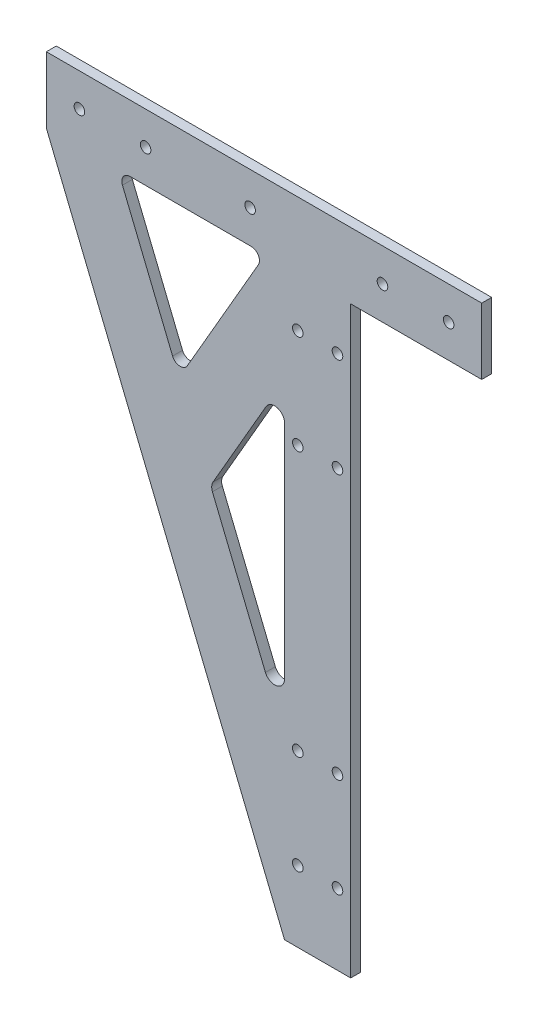
ISO-10303-21;
HEADER;
FILE_DESCRIPTION(('STEP AP214'),'2;1');
FILE_NAME('part.step','',(''),(''),'','','');
FILE_SCHEMA(('AUTOMOTIVE_DESIGN { 1 0 10303 214 1 1 1 1 }'));
ENDSEC;
DATA;
#1=APPLICATION_CONTEXT('core data for automotive mechanical design processes');
#2=APPLICATION_PROTOCOL_DEFINITION('international standard','automotive_design',2000,#1);
#3=PRODUCT_CONTEXT('',#1,'mechanical');
#4=PRODUCT('Part','Part','',(#3));
#5=PRODUCT_RELATED_PRODUCT_CATEGORY('part','',(#4));
#6=PRODUCT_DEFINITION_FORMATION('','',#4);
#7=PRODUCT_DEFINITION_CONTEXT('part definition',#1,'design');
#8=PRODUCT_DEFINITION('design','',#6,#7);
#9=PRODUCT_DEFINITION_SHAPE('','',#8);
#10=(LENGTH_UNIT() NAMED_UNIT(*) SI_UNIT(.MILLI.,.METRE.));
#11=(NAMED_UNIT(*) PLANE_ANGLE_UNIT() SI_UNIT($,.RADIAN.));
#12=(NAMED_UNIT(*) SI_UNIT($,.STERADIAN.) SOLID_ANGLE_UNIT());
#13=UNCERTAINTY_MEASURE_WITH_UNIT(LENGTH_MEASURE(1.E-05),#10,'distance_accuracy_value','');
#14=(GEOMETRIC_REPRESENTATION_CONTEXT(3) GLOBAL_UNCERTAINTY_ASSIGNED_CONTEXT((#13)) GLOBAL_UNIT_ASSIGNED_CONTEXT((#10,
#11,#12)) REPRESENTATION_CONTEXT('',''));
#15=CARTESIAN_POINT('',(0.,0.,0.));
#16=DIRECTION('',(0.,0.,1.));
#17=DIRECTION('',(1.,0.,0.));
#18=AXIS2_PLACEMENT_3D('',#15,#16,#17);
#19=CARTESIAN_POINT('',(0.,0.,3.));
#20=DIRECTION('',(0.,0.,1.));
#21=DIRECTION('',(1.,0.,0.));
#22=AXIS2_PLACEMENT_3D('',#19,#20,#21);
#23=PLANE('',#22);
#24=CARTESIAN_POINT('',(-204.458183995333,9.99999999999998,3.));
#25=DIRECTION('',(0.,0.,1.));
#26=DIRECTION('',(1.,0.,0.));
#27=AXIS2_PLACEMENT_3D('',#24,#25,#26);
#28=CIRCLE('',#27,1.60000000000002);
#29=CARTESIAN_POINT('',(-202.858183995333,9.99999999999998,3.));
#30=VERTEX_POINT('',#29);
#31=EDGE_CURVE('E268',#30,#30,#28,.T.);
#32=ORIENTED_EDGE('',*,*,#31,.F.);
#33=EDGE_LOOP('',(#32));
#34=FACE_BOUND('',#33,.T.);
#35=CARTESIAN_POINT('',(-146.458183995332,-125.,3.));
#36=DIRECTION('',(0.,0.,1.));
#37=DIRECTION('',(1.,0.,0.));
#38=AXIS2_PLACEMENT_3D('',#35,#36,#37);
#39=CIRCLE('',#38,1.59999999999999);
#40=CARTESIAN_POINT('',(-144.858183995332,-125.,3.));
#41=VERTEX_POINT('',#40);
#42=EDGE_CURVE('E280',#41,#41,#39,.T.);
#43=ORIENTED_EDGE('',*,*,#42,.F.);
#44=EDGE_LOOP('',(#43));
#45=FACE_BOUND('',#44,.T.);
#46=CARTESIAN_POINT('',(-146.458183995332,-155.,3.));
#47=DIRECTION('',(0.,0.,1.));
#48=DIRECTION('',(1.,0.,0.));
#49=AXIS2_PLACEMENT_3D('',#46,#47,#48);
#50=CIRCLE('',#49,1.59999999999999);
#51=CARTESIAN_POINT('',(-144.858183995332,-155.,3.));
#52=VERTEX_POINT('',#51);
#53=EDGE_CURVE('E292',#52,#52,#50,.T.);
#54=ORIENTED_EDGE('',*,*,#53,.F.);
#55=EDGE_LOOP('',(#54));
#56=FACE_BOUND('',#55,.T.);
#57=CARTESIAN_POINT('',(-146.458183995333,-15.,3.));
#58=DIRECTION('',(0.,0.,1.));
#59=DIRECTION('',(1.,0.,0.));
#60=AXIS2_PLACEMENT_3D('',#57,#58,#59);
#61=CIRCLE('',#60,1.59999999999999);
#62=CARTESIAN_POINT('',(-144.858183995333,-15.,3.));
#63=VERTEX_POINT('',#62);
#64=EDGE_CURVE('E304',#63,#63,#61,.T.);
#65=ORIENTED_EDGE('',*,*,#64,.F.);
#66=EDGE_LOOP('',(#65));
#67=FACE_BOUND('',#66,.T.);
#68=CARTESIAN_POINT('',(-146.458183995333,-45.,3.));
#69=DIRECTION('',(0.,0.,1.));
#70=DIRECTION('',(1.,0.,0.));
#71=AXIS2_PLACEMENT_3D('',#68,#69,#70);
#72=CIRCLE('',#71,1.59999999999999);
#73=CARTESIAN_POINT('',(-144.858183995333,-45.,3.));
#74=VERTEX_POINT('',#73);
#75=EDGE_CURVE('E316',#74,#74,#72,.T.);
#76=ORIENTED_EDGE('',*,*,#75,.F.);
#77=EDGE_LOOP('',(#76));
#78=FACE_BOUND('',#77,.T.);
#79=CARTESIAN_POINT('',(-132.858183995333,10.,3.));
#80=DIRECTION('',(0.,0.,1.));
#81=DIRECTION('',(1.,0.,0.));
#82=AXIS2_PLACEMENT_3D('',#79,#80,#81);
#83=CIRCLE('',#82,1.60000000000002);
#84=CARTESIAN_POINT('',(-131.258183995333,10.,3.));
#85=VERTEX_POINT('',#84);
#86=EDGE_CURVE('E328',#85,#85,#83,.T.);
#87=ORIENTED_EDGE('',*,*,#86,.F.);
#88=EDGE_LOOP('',(#87));
#89=FACE_BOUND('',#88,.T.);
#90=DIRECTION('',(0.,-1.,0.));
#91=VECTOR('',#90,1.);
#92=CARTESIAN_POINT('',(-234.458183995333,20.,3.));
#93=LINE('',#92,#91);
#94=CARTESIAN_POINT('',(-234.458183995333,20.,3.));
#95=VERTEX_POINT('',#94);
#96=CARTESIAN_POINT('',(-234.458183995333,0.,3.));
#97=VERTEX_POINT('',#96);
#98=EDGE_CURVE('E340',#95,#97,#93,.T.);
#99=ORIENTED_EDGE('',*,*,#98,.T.);
#100=DIRECTION('',(0.377767413930532,-0.925900524339542,0.));
#101=VECTOR('',#100,1.);
#102=CARTESIAN_POINT('',(-234.458183995333,0.,3.));
#103=LINE('',#102,#101);
#104=CARTESIAN_POINT('',(-162.458183995333,-176.470588235295,3.));
#105=VERTEX_POINT('',#104);
#106=EDGE_CURVE('E343',#97,#105,#103,.T.);
#107=ORIENTED_EDGE('',*,*,#106,.T.);
#108=DIRECTION('',(1.,0.,0.));
#109=VECTOR('',#108,1.);
#110=CARTESIAN_POINT('',(-162.458183995333,-176.470588235295,3.));
#111=LINE('',#110,#109);
#112=CARTESIAN_POINT('',(-142.458183995333,-176.470588235295,3.));
#113=VERTEX_POINT('',#112);
#114=EDGE_CURVE('E346',#105,#113,#111,.T.);
#115=ORIENTED_EDGE('',*,*,#114,.T.);
#116=DIRECTION('',(0.,1.,0.));
#117=VECTOR('',#116,1.);
#118=CARTESIAN_POINT('',(-142.458183995333,-176.470588235295,3.));
#119=LINE('',#118,#117);
#120=CARTESIAN_POINT('',(-142.458183995333,0.,3.));
#121=VERTEX_POINT('',#120);
#122=EDGE_CURVE('E348',#113,#121,#119,.T.);
#123=ORIENTED_EDGE('',*,*,#122,.T.);
#124=DIRECTION('',(1.,0.,0.));
#125=VECTOR('',#124,1.);
#126=CARTESIAN_POINT('',(-102.858183995333,0.,3.));
#127=LINE('',#126,#125);
#128=CARTESIAN_POINT('',(-102.858183995333,0.,3.));
#129=VERTEX_POINT('',#128);
#130=EDGE_CURVE('E350',#121,#129,#127,.T.);
#131=ORIENTED_EDGE('',*,*,#130,.T.);
#132=DIRECTION('',(0.,1.,0.));
#133=VECTOR('',#132,1.);
#134=CARTESIAN_POINT('',(-102.858183995333,20.,3.));
#135=LINE('',#134,#133);
#136=CARTESIAN_POINT('',(-102.858183995333,20.,3.));
#137=VERTEX_POINT('',#136);
#138=EDGE_CURVE('E352',#129,#137,#135,.T.);
#139=ORIENTED_EDGE('',*,*,#138,.T.);
#140=DIRECTION('',(-1.,0.,0.));
#141=VECTOR('',#140,1.);
#142=CARTESIAN_POINT('',(-102.863553327282,20.,3.));
#143=LINE('',#142,#141);
#144=EDGE_CURVE('E354',#137,#95,#143,.T.);
#145=ORIENTED_EDGE('',*,*,#144,.T.);
#146=EDGE_LOOP('',(#99,#107,#115,#123,#131,#139,#145));
#147=FACE_BOUND('',#146,.T.);
#148=CARTESIAN_POINT('',(-112.858183995333,10.,3.));
#149=DIRECTION('',(0.,0.,1.));
#150=DIRECTION('',(1.,0.,0.));
#151=AXIS2_PLACEMENT_3D('',#148,#149,#150);
#152=CIRCLE('',#151,1.6);
#153=CARTESIAN_POINT('',(-111.258183995333,10.,3.));
#154=VERTEX_POINT('',#153);
#155=EDGE_CURVE('E334',#154,#154,#152,.T.);
#156=ORIENTED_EDGE('',*,*,#155,.F.);
#157=EDGE_LOOP('',(#156));
#158=FACE_BOUND('',#157,.T.);
#159=CARTESIAN_POINT('',(-172.858183995333,10.,3.));
#160=DIRECTION('',(0.,0.,1.));
#161=DIRECTION('',(1.,0.,0.));
#162=AXIS2_PLACEMENT_3D('',#159,#160,#161);
#163=CIRCLE('',#162,1.59999999999999);
#164=CARTESIAN_POINT('',(-171.258183995333,10.,3.));
#165=VERTEX_POINT('',#164);
#166=EDGE_CURVE('E322',#165,#165,#163,.T.);
#167=ORIENTED_EDGE('',*,*,#166,.F.);
#168=EDGE_LOOP('',(#167));
#169=FACE_BOUND('',#168,.T.);
#170=CARTESIAN_POINT('',(-158.458183995333,-45.,3.));
#171=DIRECTION('',(0.,0.,1.));
#172=DIRECTION('',(1.,0.,0.));
#173=AXIS2_PLACEMENT_3D('',#170,#171,#172);
#174=CIRCLE('',#173,1.59999999999999);
#175=CARTESIAN_POINT('',(-156.858183995333,-45.,3.));
#176=VERTEX_POINT('',#175);
#177=EDGE_CURVE('E310',#176,#176,#174,.T.);
#178=ORIENTED_EDGE('',*,*,#177,.F.);
#179=EDGE_LOOP('',(#178));
#180=FACE_BOUND('',#179,.T.);
#181=CARTESIAN_POINT('',(-158.458183995333,-15.,3.));
#182=DIRECTION('',(0.,0.,1.));
#183=DIRECTION('',(1.,0.,0.));
#184=AXIS2_PLACEMENT_3D('',#181,#182,#183);
#185=CIRCLE('',#184,1.59999999999999);
#186=CARTESIAN_POINT('',(-156.858183995333,-15.,3.));
#187=VERTEX_POINT('',#186);
#188=EDGE_CURVE('E298',#187,#187,#185,.T.);
#189=ORIENTED_EDGE('',*,*,#188,.F.);
#190=EDGE_LOOP('',(#189));
#191=FACE_BOUND('',#190,.T.);
#192=CARTESIAN_POINT('',(-158.458183995332,-155.,3.));
#193=DIRECTION('',(0.,0.,1.));
#194=DIRECTION('',(1.,0.,0.));
#195=AXIS2_PLACEMENT_3D('',#192,#193,#194);
#196=CIRCLE('',#195,1.59999999999999);
#197=CARTESIAN_POINT('',(-156.858183995332,-155.,3.));
#198=VERTEX_POINT('',#197);
#199=EDGE_CURVE('E286',#198,#198,#196,.T.);
#200=ORIENTED_EDGE('',*,*,#199,.F.);
#201=EDGE_LOOP('',(#200));
#202=FACE_BOUND('',#201,.T.);
#203=CARTESIAN_POINT('',(-224.458183995333,9.99999999999998,3.));
#204=DIRECTION('',(0.,0.,1.));
#205=DIRECTION('',(1.,0.,0.));
#206=AXIS2_PLACEMENT_3D('',#203,#204,#205);
#207=CIRCLE('',#206,1.59999999999999);
#208=CARTESIAN_POINT('',(-222.858183995333,9.99999999999998,3.));
#209=VERTEX_POINT('',#208);
#210=EDGE_CURVE('E274',#209,#209,#207,.T.);
#211=ORIENTED_EDGE('',*,*,#210,.F.);
#212=EDGE_LOOP('',(#211));
#213=FACE_BOUND('',#212,.T.);
#214=CARTESIAN_POINT('',(-158.458183995332,-125.,3.));
#215=DIRECTION('',(0.,0.,1.));
#216=DIRECTION('',(1.,0.,0.));
#217=AXIS2_PLACEMENT_3D('',#214,#215,#216);
#218=CIRCLE('',#217,1.59999999999999);
#219=CARTESIAN_POINT('',(-156.858183995332,-125.,3.));
#220=VERTEX_POINT('',#219);
#221=EDGE_CURVE('E262',#220,#220,#218,.T.);
#222=ORIENTED_EDGE('',*,*,#221,.F.);
#223=EDGE_LOOP('',(#222));
#224=FACE_BOUND('',#223,.T.);
#225=DIRECTION('',(0.,1.,0.));
#226=VECTOR('',#225,1.);
#227=CARTESIAN_POINT('',(-162.458183995333,-41.1961524227068,3.));
#228=LINE('',#227,#226);
#229=CARTESIAN_POINT('',(-162.458183995333,-108.23362384281,3.));
#230=VERTEX_POINT('',#229);
#231=CARTESIAN_POINT('',(-162.458183995333,-41.1961524227068,3.));
#232=VERTEX_POINT('',#231);
#233=EDGE_CURVE('E219',#230,#232,#228,.T.);
#234=ORIENTED_EDGE('',*,*,#233,.F.);
#235=CARTESIAN_POINT('',(-165.458183995333,-108.233623842811,3.));
#236=DIRECTION('',(0.,0.,1.));
#237=DIRECTION('',(-1.,0.,0.));
#238=AXIS2_PLACEMENT_3D('',#235,#236,#237);
#239=CIRCLE('',#238,3.);
#240=CARTESIAN_POINT('',(-168.235885568352,-109.366926084602,3.));
#241=VERTEX_POINT('',#240);
#242=EDGE_CURVE('E217',#241,#230,#239,.T.);
#243=ORIENTED_EDGE('',*,*,#242,.F.);
#244=DIRECTION('',(0.377767413930531,-0.925900524339542,0.));
#245=VECTOR('',#244,1.);
#246=CARTESIAN_POINT('',(-168.235885568352,-109.366926084602,3.));
#247=LINE('',#246,#245);
#248=CARTESIAN_POINT('',(-184.261936587168,-70.0873892737789,3.));
#249=VERTEX_POINT('',#248);
#250=EDGE_CURVE('E229',#249,#241,#247,.T.);
#251=ORIENTED_EDGE('',*,*,#250,.F.);
#252=CARTESIAN_POINT('',(-181.484235014149,-68.9540870319873,3.));
#253=DIRECTION('',(0.,0.,1.));
#254=DIRECTION('',(-1.,0.,0.));
#255=AXIS2_PLACEMENT_3D('',#252,#253,#254);
#256=CIRCLE('',#255,3.00000000000001);
#257=CARTESIAN_POINT('',(-184.082311225502,-67.4540870319873,3.));
#258=VERTEX_POINT('',#257);
#259=EDGE_CURVE('E226',#258,#249,#256,.T.);
#260=ORIENTED_EDGE('',*,*,#259,.F.);
#261=DIRECTION('',(-0.499999999999994,-0.866025403784442,0.));
#262=VECTOR('',#261,1.);
#263=CARTESIAN_POINT('',(-184.082311225502,-67.4540870319873,3.));
#264=LINE('',#263,#262);
#265=CARTESIAN_POINT('',(-168.056260206686,-39.6961524227068,3.));
#266=VERTEX_POINT('',#265);
#267=EDGE_CURVE('E224',#266,#258,#264,.T.);
#268=ORIENTED_EDGE('',*,*,#267,.F.);
#269=CARTESIAN_POINT('',(-165.458183995333,-41.1961524227068,3.));
#270=DIRECTION('',(0.,0.,1.));
#271=DIRECTION('',(1.,0.,0.));
#272=AXIS2_PLACEMENT_3D('',#269,#270,#271);
#273=CIRCLE('',#272,3.00000000000001);
#274=EDGE_CURVE('E222',#232,#266,#273,.T.);
#275=ORIENTED_EDGE('',*,*,#274,.F.);
#276=EDGE_LOOP('',(#234,#243,#251,#260,#268,#275));
#277=FACE_BOUND('',#276,.T.);
#278=DIRECTION('',(-1.,0.,0.));
#279=VECTOR('',#278,1.);
#280=CARTESIAN_POINT('',(-209.152667208007,0.,3.));
#281=LINE('',#280,#279);
#282=CARTESIAN_POINT('',(-172.544179416893,0.,3.));
#283=VERTEX_POINT('',#282);
#284=CARTESIAN_POINT('',(-209.152667208007,0.,3.));
#285=VERTEX_POINT('',#284);
#286=EDGE_CURVE('E174',#283,#285,#281,.T.);
#287=ORIENTED_EDGE('',*,*,#286,.F.);
#288=CARTESIAN_POINT('',(-172.544179416893,-2.48981883834943,3.));
#289=DIRECTION('',(0.,0.,1.));
#290=DIRECTION('',(1.,0.,0.));
#291=AXIS2_PLACEMENT_3D('',#288,#289,#290);
#292=CIRCLE('',#291,2.48981883834942);
#293=CARTESIAN_POINT('',(-170.387933052061,-3.73472825752405,3.));
#294=VERTEX_POINT('',#293);
#295=EDGE_CURVE('E166',#294,#283,#292,.T.);
#296=ORIENTED_EDGE('',*,*,#295,.F.);
#297=DIRECTION('',(0.499999999999995,0.866025403784441,0.));
#298=VECTOR('',#297,1.);
#299=CARTESIAN_POINT('',(-170.387933052061,-3.73472825752405,3.));
#300=LINE('',#299,#298);
#301=CARTESIAN_POINT('',(-191.838092393072,-40.8874940666029,3.));
#302=VERTEX_POINT('',#301);
#303=EDGE_CURVE('E195',#302,#294,#300,.T.);
#304=ORIENTED_EDGE('',*,*,#303,.F.);
#305=CARTESIAN_POINT('',(-193.994338757903,-39.6425846474281,3.));
#306=DIRECTION('',(0.,0.,1.));
#307=DIRECTION('',(-1.,0.,0.));
#308=AXIS2_PLACEMENT_3D('',#305,#306,#307);
#309=CIRCLE('',#308,2.48981883834939);
#310=CARTESIAN_POINT('',(-196.299663325841,-40.583157071147,3.));
#311=VERTEX_POINT('',#310);
#312=EDGE_CURVE('E193',#311,#302,#309,.T.);
#313=ORIENTED_EDGE('',*,*,#312,.F.);
#314=DIRECTION('',(0.377767413930531,-0.925900524339542,0.));
#315=VECTOR('',#314,1.);
#316=CARTESIAN_POINT('',(-196.299663325841,-40.583157071147,3.));
#317=LINE('',#316,#315);
#318=CARTESIAN_POINT('',(-211.457991775945,-3.43039126206821,3.));
#319=VERTEX_POINT('',#318);
#320=EDGE_CURVE('E189',#319,#311,#317,.T.);
#321=ORIENTED_EDGE('',*,*,#320,.F.);
#322=CARTESIAN_POINT('',(-209.152667208007,-2.48981883834943,3.));
#323=DIRECTION('',(0.,0.,1.));
#324=DIRECTION('',(-1.,0.,0.));
#325=AXIS2_PLACEMENT_3D('',#322,#323,#324);
#326=CIRCLE('',#325,2.48981883834942);
#327=EDGE_CURVE('E187',#285,#319,#326,.T.);
#328=ORIENTED_EDGE('',*,*,#327,.F.);
#329=EDGE_LOOP('',(#287,#296,#304,#313,#321,#328));
#330=FACE_BOUND('',#329,.T.);
#331=ADVANCED_FACE('F35',(#34,#45,#56,#67,#78,#89,#147,#158,#169,#180,#191,#202,#213,#224,#277,
#330),#23,.T.);
#332=CARTESIAN_POINT('',(0.,0.,0.));
#333=DIRECTION('',(0.,0.,1.));
#334=DIRECTION('',(1.,0.,0.));
#335=AXIS2_PLACEMENT_3D('',#332,#333,#334);
#336=PLANE('',#335);
#337=CARTESIAN_POINT('',(-165.458183995333,-108.233623842811,0.));
#338=DIRECTION('',(0.,0.,1.));
#339=DIRECTION('',(-1.,0.,0.));
#340=AXIS2_PLACEMENT_3D('',#337,#338,#339);
#341=CIRCLE('',#340,3.);
#342=CARTESIAN_POINT('',(-168.235885568352,-109.366926084602,0.));
#343=VERTEX_POINT('',#342);
#344=CARTESIAN_POINT('',(-162.458183995333,-108.23362384281,0.));
#345=VERTEX_POINT('',#344);
#346=EDGE_CURVE('E182',#343,#345,#341,.T.);
#347=ORIENTED_EDGE('',*,*,#346,.T.);
#348=DIRECTION('',(0.,1.,0.));
#349=VECTOR('',#348,1.);
#350=CARTESIAN_POINT('',(-162.458183995333,-41.1961524227068,0.));
#351=LINE('',#350,#349);
#352=CARTESIAN_POINT('',(-162.458183995333,-41.1961524227068,0.));
#353=VERTEX_POINT('',#352);
#354=EDGE_CURVE('E234',#345,#353,#351,.T.);
#355=ORIENTED_EDGE('',*,*,#354,.T.);
#356=CARTESIAN_POINT('',(-165.458183995333,-41.1961524227068,0.));
#357=DIRECTION('',(0.,0.,1.));
#358=DIRECTION('',(1.,0.,0.));
#359=AXIS2_PLACEMENT_3D('',#356,#357,#358);
#360=CIRCLE('',#359,3.00000000000001);
#361=CARTESIAN_POINT('',(-168.056260206686,-39.6961524227068,0.));
#362=VERTEX_POINT('',#361);
#363=EDGE_CURVE('E237',#353,#362,#360,.T.);
#364=ORIENTED_EDGE('',*,*,#363,.T.);
#365=DIRECTION('',(-0.499999999999994,-0.866025403784442,0.));
#366=VECTOR('',#365,1.);
#367=CARTESIAN_POINT('',(-184.082311225502,-67.4540870319873,0.));
#368=LINE('',#367,#366);
#369=CARTESIAN_POINT('',(-184.082311225502,-67.4540870319873,0.));
#370=VERTEX_POINT('',#369);
#371=EDGE_CURVE('E240',#362,#370,#368,.T.);
#372=ORIENTED_EDGE('',*,*,#371,.T.);
#373=CARTESIAN_POINT('',(-181.484235014149,-68.9540870319873,0.));
#374=DIRECTION('',(0.,0.,1.));
#375=DIRECTION('',(-1.,0.,0.));
#376=AXIS2_PLACEMENT_3D('',#373,#374,#375);
#377=CIRCLE('',#376,3.00000000000001);
#378=CARTESIAN_POINT('',(-184.261936587168,-70.0873892737789,0.));
#379=VERTEX_POINT('',#378);
#380=EDGE_CURVE('E243',#370,#379,#377,.T.);
#381=ORIENTED_EDGE('',*,*,#380,.T.);
#382=DIRECTION('',(0.377767413930531,-0.925900524339542,0.));
#383=VECTOR('',#382,1.);
#384=CARTESIAN_POINT('',(-168.235885568352,-109.366926084602,0.));
#385=LINE('',#384,#383);
#386=EDGE_CURVE('E220',#379,#343,#385,.T.);
#387=ORIENTED_EDGE('',*,*,#386,.T.);
#388=EDGE_LOOP('',(#347,#355,#364,#372,#381,#387));
#389=FACE_BOUND('',#388,.T.);
#390=DIRECTION('',(0.,-1.,0.));
#391=VECTOR('',#390,1.);
#392=CARTESIAN_POINT('',(-234.458183995333,20.,0.));
#393=LINE('',#392,#391);
#394=CARTESIAN_POINT('',(-234.458183995333,20.,0.));
#395=VERTEX_POINT('',#394);
#396=CARTESIAN_POINT('',(-234.458183995333,0.,0.));
#397=VERTEX_POINT('',#396);
#398=EDGE_CURVE('E337',#395,#397,#393,.T.);
#399=ORIENTED_EDGE('',*,*,#398,.F.);
#400=DIRECTION('',(-1.,0.,0.));
#401=VECTOR('',#400,1.);
#402=CARTESIAN_POINT('',(-102.863553327282,20.,0.));
#403=LINE('',#402,#401);
#404=CARTESIAN_POINT('',(-102.858183995333,20.,0.));
#405=VERTEX_POINT('',#404);
#406=EDGE_CURVE('E344',#405,#395,#403,.T.);
#407=ORIENTED_EDGE('',*,*,#406,.F.);
#408=DIRECTION('',(0.,1.,0.));
#409=VECTOR('',#408,1.);
#410=CARTESIAN_POINT('',(-102.858183995333,20.,0.));
#411=LINE('',#410,#409);
#412=CARTESIAN_POINT('',(-102.858183995333,0.,0.));
#413=VERTEX_POINT('',#412);
#414=EDGE_CURVE('E367',#413,#405,#411,.T.);
#415=ORIENTED_EDGE('',*,*,#414,.F.);
#416=DIRECTION('',(1.,0.,0.));
#417=VECTOR('',#416,1.);
#418=CARTESIAN_POINT('',(-102.858183995333,0.,0.));
#419=LINE('',#418,#417);
#420=CARTESIAN_POINT('',(-142.458183995333,0.,0.));
#421=VERTEX_POINT('',#420);
#422=EDGE_CURVE('E365',#421,#413,#419,.T.);
#423=ORIENTED_EDGE('',*,*,#422,.F.);
#424=DIRECTION('',(0.,1.,0.));
#425=VECTOR('',#424,1.);
#426=CARTESIAN_POINT('',(-142.458183995333,-176.470588235295,0.));
#427=LINE('',#426,#425);
#428=CARTESIAN_POINT('',(-142.458183995333,-176.470588235295,0.));
#429=VERTEX_POINT('',#428);
#430=EDGE_CURVE('E363',#429,#421,#427,.T.);
#431=ORIENTED_EDGE('',*,*,#430,.F.);
#432=DIRECTION('',(1.,0.,0.));
#433=VECTOR('',#432,1.);
#434=CARTESIAN_POINT('',(-162.458183995333,-176.470588235295,0.));
#435=LINE('',#434,#433);
#436=CARTESIAN_POINT('',(-162.458183995333,-176.470588235295,0.));
#437=VERTEX_POINT('',#436);
#438=EDGE_CURVE('E361',#437,#429,#435,.T.);
#439=ORIENTED_EDGE('',*,*,#438,.F.);
#440=DIRECTION('',(0.377767413930532,-0.925900524339542,0.));
#441=VECTOR('',#440,1.);
#442=CARTESIAN_POINT('',(-234.458183995333,0.,0.));
#443=LINE('',#442,#441);
#444=EDGE_CURVE('E359',#397,#437,#443,.T.);
#445=ORIENTED_EDGE('',*,*,#444,.F.);
#446=EDGE_LOOP('',(#399,#407,#415,#423,#431,#439,#445));
#447=FACE_BOUND('',#446,.T.);
#448=CARTESIAN_POINT('',(-112.858183995333,10.,0.));
#449=DIRECTION('',(0.,0.,1.));
#450=DIRECTION('',(1.,0.,0.));
#451=AXIS2_PLACEMENT_3D('',#448,#449,#450);
#452=CIRCLE('',#451,1.6);
#453=CARTESIAN_POINT('',(-111.258183995333,10.,0.));
#454=VERTEX_POINT('',#453);
#455=EDGE_CURVE('E331',#454,#454,#452,.T.);
#456=ORIENTED_EDGE('',*,*,#455,.T.);
#457=EDGE_LOOP('',(#456));
#458=FACE_BOUND('',#457,.T.);
#459=CARTESIAN_POINT('',(-132.858183995333,10.,0.));
#460=DIRECTION('',(0.,0.,1.));
#461=DIRECTION('',(1.,0.,0.));
#462=AXIS2_PLACEMENT_3D('',#459,#460,#461);
#463=CIRCLE('',#462,1.60000000000002);
#464=CARTESIAN_POINT('',(-131.258183995333,10.,0.));
#465=VERTEX_POINT('',#464);
#466=EDGE_CURVE('E325',#465,#465,#463,.T.);
#467=ORIENTED_EDGE('',*,*,#466,.T.);
#468=EDGE_LOOP('',(#467));
#469=FACE_BOUND('',#468,.T.);
#470=CARTESIAN_POINT('',(-172.858183995333,10.,0.));
#471=DIRECTION('',(0.,0.,1.));
#472=DIRECTION('',(1.,0.,0.));
#473=AXIS2_PLACEMENT_3D('',#470,#471,#472);
#474=CIRCLE('',#473,1.59999999999999);
#475=CARTESIAN_POINT('',(-171.258183995333,10.,0.));
#476=VERTEX_POINT('',#475);
#477=EDGE_CURVE('E319',#476,#476,#474,.T.);
#478=ORIENTED_EDGE('',*,*,#477,.T.);
#479=EDGE_LOOP('',(#478));
#480=FACE_BOUND('',#479,.T.);
#481=CARTESIAN_POINT('',(-146.458183995333,-45.,0.));
#482=DIRECTION('',(0.,0.,1.));
#483=DIRECTION('',(1.,0.,0.));
#484=AXIS2_PLACEMENT_3D('',#481,#482,#483);
#485=CIRCLE('',#484,1.59999999999999);
#486=CARTESIAN_POINT('',(-144.858183995333,-45.,0.));
#487=VERTEX_POINT('',#486);
#488=EDGE_CURVE('E313',#487,#487,#485,.T.);
#489=ORIENTED_EDGE('',*,*,#488,.T.);
#490=EDGE_LOOP('',(#489));
#491=FACE_BOUND('',#490,.T.);
#492=CARTESIAN_POINT('',(-158.458183995333,-45.,0.));
#493=DIRECTION('',(0.,0.,1.));
#494=DIRECTION('',(1.,0.,0.));
#495=AXIS2_PLACEMENT_3D('',#492,#493,#494);
#496=CIRCLE('',#495,1.59999999999999);
#497=CARTESIAN_POINT('',(-156.858183995333,-45.,0.));
#498=VERTEX_POINT('',#497);
#499=EDGE_CURVE('E307',#498,#498,#496,.T.);
#500=ORIENTED_EDGE('',*,*,#499,.T.);
#501=EDGE_LOOP('',(#500));
#502=FACE_BOUND('',#501,.T.);
#503=CARTESIAN_POINT('',(-146.458183995333,-15.,0.));
#504=DIRECTION('',(0.,0.,1.));
#505=DIRECTION('',(1.,0.,0.));
#506=AXIS2_PLACEMENT_3D('',#503,#504,#505);
#507=CIRCLE('',#506,1.59999999999999);
#508=CARTESIAN_POINT('',(-144.858183995333,-15.,0.));
#509=VERTEX_POINT('',#508);
#510=EDGE_CURVE('E301',#509,#509,#507,.T.);
#511=ORIENTED_EDGE('',*,*,#510,.T.);
#512=EDGE_LOOP('',(#511));
#513=FACE_BOUND('',#512,.T.);
#514=CARTESIAN_POINT('',(-158.458183995333,-15.,0.));
#515=DIRECTION('',(0.,0.,1.));
#516=DIRECTION('',(1.,0.,0.));
#517=AXIS2_PLACEMENT_3D('',#514,#515,#516);
#518=CIRCLE('',#517,1.59999999999999);
#519=CARTESIAN_POINT('',(-156.858183995333,-15.,0.));
#520=VERTEX_POINT('',#519);
#521=EDGE_CURVE('E295',#520,#520,#518,.T.);
#522=ORIENTED_EDGE('',*,*,#521,.T.);
#523=EDGE_LOOP('',(#522));
#524=FACE_BOUND('',#523,.T.);
#525=CARTESIAN_POINT('',(-146.458183995332,-155.,0.));
#526=DIRECTION('',(0.,0.,1.));
#527=DIRECTION('',(1.,0.,0.));
#528=AXIS2_PLACEMENT_3D('',#525,#526,#527);
#529=CIRCLE('',#528,1.59999999999999);
#530=CARTESIAN_POINT('',(-144.858183995332,-155.,0.));
#531=VERTEX_POINT('',#530);
#532=EDGE_CURVE('E289',#531,#531,#529,.T.);
#533=ORIENTED_EDGE('',*,*,#532,.T.);
#534=EDGE_LOOP('',(#533));
#535=FACE_BOUND('',#534,.T.);
#536=CARTESIAN_POINT('',(-158.458183995332,-155.,0.));
#537=DIRECTION('',(0.,0.,1.));
#538=DIRECTION('',(1.,0.,0.));
#539=AXIS2_PLACEMENT_3D('',#536,#537,#538);
#540=CIRCLE('',#539,1.59999999999999);
#541=CARTESIAN_POINT('',(-156.858183995332,-155.,0.));
#542=VERTEX_POINT('',#541);
#543=EDGE_CURVE('E283',#542,#542,#540,.T.);
#544=ORIENTED_EDGE('',*,*,#543,.T.);
#545=EDGE_LOOP('',(#544));
#546=FACE_BOUND('',#545,.T.);
#547=CARTESIAN_POINT('',(-146.458183995332,-125.,0.));
#548=DIRECTION('',(0.,0.,1.));
#549=DIRECTION('',(1.,0.,0.));
#550=AXIS2_PLACEMENT_3D('',#547,#548,#549);
#551=CIRCLE('',#550,1.59999999999999);
#552=CARTESIAN_POINT('',(-144.858183995332,-125.,0.));
#553=VERTEX_POINT('',#552);
#554=EDGE_CURVE('E277',#553,#553,#551,.T.);
#555=ORIENTED_EDGE('',*,*,#554,.T.);
#556=EDGE_LOOP('',(#555));
#557=FACE_BOUND('',#556,.T.);
#558=CARTESIAN_POINT('',(-224.458183995333,9.99999999999998,0.));
#559=DIRECTION('',(0.,0.,1.));
#560=DIRECTION('',(1.,0.,0.));
#561=AXIS2_PLACEMENT_3D('',#558,#559,#560);
#562=CIRCLE('',#561,1.59999999999999);
#563=CARTESIAN_POINT('',(-222.858183995333,9.99999999999998,0.));
#564=VERTEX_POINT('',#563);
#565=EDGE_CURVE('E271',#564,#564,#562,.T.);
#566=ORIENTED_EDGE('',*,*,#565,.T.);
#567=EDGE_LOOP('',(#566));
#568=FACE_BOUND('',#567,.T.);
#569=CARTESIAN_POINT('',(-204.458183995333,9.99999999999998,0.));
#570=DIRECTION('',(0.,0.,1.));
#571=DIRECTION('',(1.,0.,0.));
#572=AXIS2_PLACEMENT_3D('',#569,#570,#571);
#573=CIRCLE('',#572,1.60000000000002);
#574=CARTESIAN_POINT('',(-202.858183995333,9.99999999999998,0.));
#575=VERTEX_POINT('',#574);
#576=EDGE_CURVE('E265',#575,#575,#573,.T.);
#577=ORIENTED_EDGE('',*,*,#576,.T.);
#578=EDGE_LOOP('',(#577));
#579=FACE_BOUND('',#578,.T.);
#580=CARTESIAN_POINT('',(-158.458183995332,-125.,0.));
#581=DIRECTION('',(0.,0.,1.));
#582=DIRECTION('',(1.,0.,0.));
#583=AXIS2_PLACEMENT_3D('',#580,#581,#582);
#584=CIRCLE('',#583,1.59999999999999);
#585=CARTESIAN_POINT('',(-156.858183995332,-125.,0.));
#586=VERTEX_POINT('',#585);
#587=EDGE_CURVE('E261',#586,#586,#584,.T.);
#588=ORIENTED_EDGE('',*,*,#587,.T.);
#589=EDGE_LOOP('',(#588));
#590=FACE_BOUND('',#589,.T.);
#591=CARTESIAN_POINT('',(-172.544179416893,-2.48981883834943,0.));
#592=DIRECTION('',(0.,0.,1.));
#593=DIRECTION('',(1.,0.,0.));
#594=AXIS2_PLACEMENT_3D('',#591,#592,#593);
#595=CIRCLE('',#594,2.48981883834942);
#596=CARTESIAN_POINT('',(-170.387933052061,-3.73472825752404,0.));
#597=VERTEX_POINT('',#596);
#598=CARTESIAN_POINT('',(-172.544179416893,0.,0.));
#599=VERTEX_POINT('',#598);
#600=EDGE_CURVE('E58',#597,#599,#595,.T.);
#601=ORIENTED_EDGE('',*,*,#600,.T.);
#602=DIRECTION('',(-1.,0.,0.));
#603=VECTOR('',#602,1.);
#604=CARTESIAN_POINT('',(-209.152667208007,0.,0.));
#605=LINE('',#604,#603);
#606=CARTESIAN_POINT('',(-209.152667208007,0.,0.));
#607=VERTEX_POINT('',#606);
#608=EDGE_CURVE('E181',#599,#607,#605,.T.);
#609=ORIENTED_EDGE('',*,*,#608,.T.);
#610=CARTESIAN_POINT('',(-209.152667208007,-2.48981883834943,0.));
#611=DIRECTION('',(0.,0.,1.));
#612=DIRECTION('',(-1.,0.,0.));
#613=AXIS2_PLACEMENT_3D('',#610,#611,#612);
#614=CIRCLE('',#613,2.48981883834942);
#615=CARTESIAN_POINT('',(-211.457991775945,-3.43039126206821,0.));
#616=VERTEX_POINT('',#615);
#617=EDGE_CURVE('E199',#607,#616,#614,.T.);
#618=ORIENTED_EDGE('',*,*,#617,.T.);
#619=DIRECTION('',(0.377767413930531,-0.925900524339542,0.));
#620=VECTOR('',#619,1.);
#621=CARTESIAN_POINT('',(-196.299663325841,-40.583157071147,0.));
#622=LINE('',#621,#620);
#623=CARTESIAN_POINT('',(-196.299663325841,-40.583157071147,0.));
#624=VERTEX_POINT('',#623);
#625=EDGE_CURVE('E202',#616,#624,#622,.T.);
#626=ORIENTED_EDGE('',*,*,#625,.T.);
#627=CARTESIAN_POINT('',(-193.994338757903,-39.6425846474281,0.));
#628=DIRECTION('',(0.,0.,1.));
#629=DIRECTION('',(-1.,0.,0.));
#630=AXIS2_PLACEMENT_3D('',#627,#628,#629);
#631=CIRCLE('',#630,2.48981883834939);
#632=CARTESIAN_POINT('',(-191.838092393072,-40.8874940666029,0.));
#633=VERTEX_POINT('',#632);
#634=EDGE_CURVE('E205',#624,#633,#631,.T.);
#635=ORIENTED_EDGE('',*,*,#634,.T.);
#636=DIRECTION('',(0.499999999999995,0.866025403784441,0.));
#637=VECTOR('',#636,1.);
#638=CARTESIAN_POINT('',(-170.387933052061,-3.73472825752405,0.));
#639=LINE('',#638,#637);
#640=EDGE_CURVE('E175',#633,#597,#639,.T.);
#641=ORIENTED_EDGE('',*,*,#640,.T.);
#642=EDGE_LOOP('',(#601,#609,#618,#626,#635,#641));
#643=FACE_BOUND('',#642,.T.);
#644=ADVANCED_FACE('F395',(#389,#447,#458,#469,#480,#491,#502,#513,#524,#535,#546,#557,#568,
#579,#590,#643),#336,.F.);
#645=CARTESIAN_POINT('',(-234.458183995333,20.,3.));
#646=DIRECTION('',(1.,0.,0.));
#647=DIRECTION('',(0.,0.,-1.));
#648=AXIS2_PLACEMENT_3D('',#645,#646,#647);
#649=PLANE('',#648);
#650=ORIENTED_EDGE('',*,*,#398,.T.);
#651=DIRECTION('',(0.,0.,-1.));
#652=VECTOR('',#651,1.);
#653=CARTESIAN_POINT('',(-234.458183995333,0.,3.));
#654=LINE('',#653,#652);
#655=EDGE_CURVE('E11',#97,#397,#654,.T.);
#656=ORIENTED_EDGE('',*,*,#655,.F.);
#657=ORIENTED_EDGE('',*,*,#98,.F.);
#658=DIRECTION('',(0.,0.,-1.));
#659=VECTOR('',#658,1.);
#660=CARTESIAN_POINT('',(-234.458183995333,20.,3.));
#661=LINE('',#660,#659);
#662=EDGE_CURVE('E356',#95,#395,#661,.T.);
#663=ORIENTED_EDGE('',*,*,#662,.T.);
#664=EDGE_LOOP('',(#650,#656,#657,#663));
#665=FACE_BOUND('',#664,.T.);
#666=ADVANCED_FACE('F37',(#665),#649,.F.);
#667=CARTESIAN_POINT('',(-234.458183995333,0.,3.));
#668=DIRECTION('',(0.925900524339542,0.377767413930532,0.));
#669=DIRECTION('',(-0.377767413930532,0.925900524339542,0.));
#670=AXIS2_PLACEMENT_3D('',#667,#668,#669);
#671=PLANE('',#670);
#672=ORIENTED_EDGE('',*,*,#444,.T.);
#673=DIRECTION('',(0.,0.,-1.));
#674=VECTOR('',#673,1.);
#675=CARTESIAN_POINT('',(-162.458183995333,-176.470588235295,3.));
#676=LINE('',#675,#674);
#677=EDGE_CURVE('E43',#105,#437,#676,.T.);
#678=ORIENTED_EDGE('',*,*,#677,.F.);
#679=ORIENTED_EDGE('',*,*,#106,.F.);
#680=ORIENTED_EDGE('',*,*,#655,.T.);
#681=EDGE_LOOP('',(#672,#678,#679,#680));
#682=FACE_BOUND('',#681,.T.);
#683=ADVANCED_FACE('F413',(#682),#671,.F.);
#684=CARTESIAN_POINT('',(-162.458183995333,-176.470588235295,3.));
#685=DIRECTION('',(0.,1.,0.));
#686=DIRECTION('',(0.,0.,1.));
#687=AXIS2_PLACEMENT_3D('',#684,#685,#686);
#688=PLANE('',#687);
#689=ORIENTED_EDGE('',*,*,#438,.T.);
#690=DIRECTION('',(0.,0.,-1.));
#691=VECTOR('',#690,1.);
#692=CARTESIAN_POINT('',(-142.458183995333,-176.470588235295,3.));
#693=LINE('',#692,#691);
#694=EDGE_CURVE('E382',#113,#429,#693,.T.);
#695=ORIENTED_EDGE('',*,*,#694,.F.);
#696=ORIENTED_EDGE('',*,*,#114,.F.);
#697=ORIENTED_EDGE('',*,*,#677,.T.);
#698=EDGE_LOOP('',(#689,#695,#696,#697));
#699=FACE_BOUND('',#698,.T.);
#700=ADVANCED_FACE('F389',(#699),#688,.F.);
#701=CARTESIAN_POINT('',(-142.458183995333,-176.470588235295,3.));
#702=DIRECTION('',(-1.,0.,0.));
#703=DIRECTION('',(0.,0.,1.));
#704=AXIS2_PLACEMENT_3D('',#701,#702,#703);
#705=PLANE('',#704);
#706=ORIENTED_EDGE('',*,*,#430,.T.);
#707=DIRECTION('',(0.,0.,-1.));
#708=VECTOR('',#707,1.);
#709=CARTESIAN_POINT('',(-142.458183995333,0.,3.));
#710=LINE('',#709,#708);
#711=EDGE_CURVE('E379',#121,#421,#710,.T.);
#712=ORIENTED_EDGE('',*,*,#711,.F.);
#713=ORIENTED_EDGE('',*,*,#122,.F.);
#714=ORIENTED_EDGE('',*,*,#694,.T.);
#715=EDGE_LOOP('',(#706,#712,#713,#714));
#716=FACE_BOUND('',#715,.T.);
#717=ADVANCED_FACE('F401',(#716),#705,.F.);
#718=CARTESIAN_POINT('',(-102.858183995333,0.,3.));
#719=DIRECTION('',(0.,1.,0.));
#720=DIRECTION('',(0.,0.,1.));
#721=AXIS2_PLACEMENT_3D('',#718,#719,#720);
#722=PLANE('',#721);
#723=ORIENTED_EDGE('',*,*,#422,.T.);
#724=DIRECTION('',(0.,0.,-1.));
#725=VECTOR('',#724,1.);
#726=CARTESIAN_POINT('',(-102.858183995333,0.,3.));
#727=LINE('',#726,#725);
#728=EDGE_CURVE('E376',#129,#413,#727,.T.);
#729=ORIENTED_EDGE('',*,*,#728,.F.);
#730=ORIENTED_EDGE('',*,*,#130,.F.);
#731=ORIENTED_EDGE('',*,*,#711,.T.);
#732=EDGE_LOOP('',(#723,#729,#730,#731));
#733=FACE_BOUND('',#732,.T.);
#734=ADVANCED_FACE('F405',(#733),#722,.F.);
#735=CARTESIAN_POINT('',(-102.858183995333,20.,3.));
#736=DIRECTION('',(-1.,0.,0.));
#737=DIRECTION('',(0.,0.,1.));
#738=AXIS2_PLACEMENT_3D('',#735,#736,#737);
#739=PLANE('',#738);
#740=ORIENTED_EDGE('',*,*,#414,.T.);
#741=DIRECTION('',(0.,0.,-1.));
#742=VECTOR('',#741,1.);
#743=CARTESIAN_POINT('',(-102.858183995333,20.,3.));
#744=LINE('',#743,#742);
#745=EDGE_CURVE('E373',#137,#405,#744,.T.);
#746=ORIENTED_EDGE('',*,*,#745,.F.);
#747=ORIENTED_EDGE('',*,*,#138,.F.);
#748=ORIENTED_EDGE('',*,*,#728,.T.);
#749=EDGE_LOOP('',(#740,#746,#747,#748));
#750=FACE_BOUND('',#749,.T.);
#751=ADVANCED_FACE('F418',(#750),#739,.F.);
#752=CARTESIAN_POINT('',(-102.863553327282,20.,3.));
#753=DIRECTION('',(0.,-1.,0.));
#754=DIRECTION('',(0.,0.,-1.));
#755=AXIS2_PLACEMENT_3D('',#752,#753,#754);
#756=PLANE('',#755);
#757=ORIENTED_EDGE('',*,*,#406,.T.);
#758=ORIENTED_EDGE('',*,*,#662,.F.);
#759=ORIENTED_EDGE('',*,*,#144,.F.);
#760=ORIENTED_EDGE('',*,*,#745,.T.);
#761=EDGE_LOOP('',(#757,#758,#759,#760));
#762=FACE_BOUND('',#761,.T.);
#763=ADVANCED_FACE('F420',(#762),#756,.F.);
#764=CARTESIAN_POINT('',(-112.858183995333,10.,3.));
#765=DIRECTION('',(0.,0.,-1.));
#766=DIRECTION('',(-1.,0.,0.));
#767=AXIS2_PLACEMENT_3D('',#764,#765,#766);
#768=CYLINDRICAL_SURFACE('',#767,1.6);
#769=ORIENTED_EDGE('',*,*,#155,.T.);
#770=EDGE_LOOP('',(#769));
#771=FACE_BOUND('',#770,.T.);
#772=ORIENTED_EDGE('',*,*,#455,.F.);
#773=EDGE_LOOP('',(#772));
#774=FACE_BOUND('',#773,.T.);
#775=ADVANCED_FACE('F422',(#771,#774),#768,.F.);
#776=CARTESIAN_POINT('',(-132.858183995333,10.,3.));
#777=DIRECTION('',(0.,0.,-1.));
#778=DIRECTION('',(-1.,0.,0.));
#779=AXIS2_PLACEMENT_3D('',#776,#777,#778);
#780=CYLINDRICAL_SURFACE('',#779,1.60000000000002);
#781=ORIENTED_EDGE('',*,*,#86,.T.);
#782=EDGE_LOOP('',(#781));
#783=FACE_BOUND('',#782,.T.);
#784=ORIENTED_EDGE('',*,*,#466,.F.);
#785=EDGE_LOOP('',(#784));
#786=FACE_BOUND('',#785,.T.);
#787=ADVANCED_FACE('F428',(#783,#786),#780,.F.);
#788=CARTESIAN_POINT('',(-172.858183995333,10.,3.));
#789=DIRECTION('',(0.,0.,-1.));
#790=DIRECTION('',(-1.,0.,0.));
#791=AXIS2_PLACEMENT_3D('',#788,#789,#790);
#792=CYLINDRICAL_SURFACE('',#791,1.59999999999999);
#793=ORIENTED_EDGE('',*,*,#166,.T.);
#794=EDGE_LOOP('',(#793));
#795=FACE_BOUND('',#794,.T.);
#796=ORIENTED_EDGE('',*,*,#477,.F.);
#797=EDGE_LOOP('',(#796));
#798=FACE_BOUND('',#797,.T.);
#799=ADVANCED_FACE('F445',(#795,#798),#792,.F.);
#800=CARTESIAN_POINT('',(-146.458183995333,-45.,3.));
#801=DIRECTION('',(0.,0.,-1.));
#802=DIRECTION('',(-1.,0.,0.));
#803=AXIS2_PLACEMENT_3D('',#800,#801,#802);
#804=CYLINDRICAL_SURFACE('',#803,1.59999999999999);
#805=ORIENTED_EDGE('',*,*,#75,.T.);
#806=EDGE_LOOP('',(#805));
#807=FACE_BOUND('',#806,.T.);
#808=ORIENTED_EDGE('',*,*,#488,.F.);
#809=EDGE_LOOP('',(#808));
#810=FACE_BOUND('',#809,.T.);
#811=ADVANCED_FACE('F449',(#807,#810),#804,.F.);
#812=CARTESIAN_POINT('',(-158.458183995333,-45.,3.));
#813=DIRECTION('',(0.,0.,-1.));
#814=DIRECTION('',(-1.,0.,0.));
#815=AXIS2_PLACEMENT_3D('',#812,#813,#814);
#816=CYLINDRICAL_SURFACE('',#815,1.59999999999999);
#817=ORIENTED_EDGE('',*,*,#177,.T.);
#818=EDGE_LOOP('',(#817));
#819=FACE_BOUND('',#818,.T.);
#820=ORIENTED_EDGE('',*,*,#499,.F.);
#821=EDGE_LOOP('',(#820));
#822=FACE_BOUND('',#821,.T.);
#823=ADVANCED_FACE('F453',(#819,#822),#816,.F.);
#824=CARTESIAN_POINT('',(-146.458183995333,-15.,3.));
#825=DIRECTION('',(0.,0.,-1.));
#826=DIRECTION('',(-1.,0.,0.));
#827=AXIS2_PLACEMENT_3D('',#824,#825,#826);
#828=CYLINDRICAL_SURFACE('',#827,1.59999999999999);
#829=ORIENTED_EDGE('',*,*,#64,.T.);
#830=EDGE_LOOP('',(#829));
#831=FACE_BOUND('',#830,.T.);
#832=ORIENTED_EDGE('',*,*,#510,.F.);
#833=EDGE_LOOP('',(#832));
#834=FACE_BOUND('',#833,.T.);
#835=ADVANCED_FACE('F457',(#831,#834),#828,.F.);
#836=CARTESIAN_POINT('',(-158.458183995333,-15.,3.));
#837=DIRECTION('',(0.,0.,-1.));
#838=DIRECTION('',(-1.,0.,0.));
#839=AXIS2_PLACEMENT_3D('',#836,#837,#838);
#840=CYLINDRICAL_SURFACE('',#839,1.59999999999999);
#841=ORIENTED_EDGE('',*,*,#188,.T.);
#842=EDGE_LOOP('',(#841));
#843=FACE_BOUND('',#842,.T.);
#844=ORIENTED_EDGE('',*,*,#521,.F.);
#845=EDGE_LOOP('',(#844));
#846=FACE_BOUND('',#845,.T.);
#847=ADVANCED_FACE('F461',(#843,#846),#840,.F.);
#848=CARTESIAN_POINT('',(-146.458183995332,-155.,3.));
#849=DIRECTION('',(0.,0.,-1.));
#850=DIRECTION('',(-1.,0.,0.));
#851=AXIS2_PLACEMENT_3D('',#848,#849,#850);
#852=CYLINDRICAL_SURFACE('',#851,1.59999999999999);
#853=ORIENTED_EDGE('',*,*,#53,.T.);
#854=EDGE_LOOP('',(#853));
#855=FACE_BOUND('',#854,.T.);
#856=ORIENTED_EDGE('',*,*,#532,.F.);
#857=EDGE_LOOP('',(#856));
#858=FACE_BOUND('',#857,.T.);
#859=ADVANCED_FACE('F465',(#855,#858),#852,.F.);
#860=CARTESIAN_POINT('',(-158.458183995332,-155.,3.));
#861=DIRECTION('',(0.,0.,-1.));
#862=DIRECTION('',(-1.,0.,0.));
#863=AXIS2_PLACEMENT_3D('',#860,#861,#862);
#864=CYLINDRICAL_SURFACE('',#863,1.59999999999999);
#865=ORIENTED_EDGE('',*,*,#199,.T.);
#866=EDGE_LOOP('',(#865));
#867=FACE_BOUND('',#866,.T.);
#868=ORIENTED_EDGE('',*,*,#543,.F.);
#869=EDGE_LOOP('',(#868));
#870=FACE_BOUND('',#869,.T.);
#871=ADVANCED_FACE('F469',(#867,#870),#864,.F.);
#872=CARTESIAN_POINT('',(-146.458183995332,-125.,3.));
#873=DIRECTION('',(0.,0.,-1.));
#874=DIRECTION('',(-1.,0.,0.));
#875=AXIS2_PLACEMENT_3D('',#872,#873,#874);
#876=CYLINDRICAL_SURFACE('',#875,1.59999999999999);
#877=ORIENTED_EDGE('',*,*,#42,.T.);
#878=EDGE_LOOP('',(#877));
#879=FACE_BOUND('',#878,.T.);
#880=ORIENTED_EDGE('',*,*,#554,.F.);
#881=EDGE_LOOP('',(#880));
#882=FACE_BOUND('',#881,.T.);
#883=ADVANCED_FACE('F473',(#879,#882),#876,.F.);
#884=CARTESIAN_POINT('',(-224.458183995333,9.99999999999998,3.));
#885=DIRECTION('',(0.,0.,-1.));
#886=DIRECTION('',(-1.,0.,0.));
#887=AXIS2_PLACEMENT_3D('',#884,#885,#886);
#888=CYLINDRICAL_SURFACE('',#887,1.59999999999999);
#889=ORIENTED_EDGE('',*,*,#210,.T.);
#890=EDGE_LOOP('',(#889));
#891=FACE_BOUND('',#890,.T.);
#892=ORIENTED_EDGE('',*,*,#565,.F.);
#893=EDGE_LOOP('',(#892));
#894=FACE_BOUND('',#893,.T.);
#895=ADVANCED_FACE('F477',(#891,#894),#888,.F.);
#896=CARTESIAN_POINT('',(-204.458183995333,9.99999999999998,3.));
#897=DIRECTION('',(0.,0.,-1.));
#898=DIRECTION('',(-1.,0.,0.));
#899=AXIS2_PLACEMENT_3D('',#896,#897,#898);
#900=CYLINDRICAL_SURFACE('',#899,1.60000000000002);
#901=ORIENTED_EDGE('',*,*,#31,.T.);
#902=EDGE_LOOP('',(#901));
#903=FACE_BOUND('',#902,.T.);
#904=ORIENTED_EDGE('',*,*,#576,.F.);
#905=EDGE_LOOP('',(#904));
#906=FACE_BOUND('',#905,.T.);
#907=ADVANCED_FACE('F481',(#903,#906),#900,.F.);
#908=CARTESIAN_POINT('',(-158.458183995332,-125.,3.));
#909=DIRECTION('',(0.,0.,-1.));
#910=DIRECTION('',(-1.,0.,0.));
#911=AXIS2_PLACEMENT_3D('',#908,#909,#910);
#912=CYLINDRICAL_SURFACE('',#911,1.59999999999999);
#913=ORIENTED_EDGE('',*,*,#221,.T.);
#914=EDGE_LOOP('',(#913));
#915=FACE_BOUND('',#914,.T.);
#916=ORIENTED_EDGE('',*,*,#587,.F.);
#917=EDGE_LOOP('',(#916));
#918=FACE_BOUND('',#917,.T.);
#919=ADVANCED_FACE('F485',(#915,#918),#912,.F.);
#920=CARTESIAN_POINT('',(-165.458183995333,-108.233623842811,3.));
#921=DIRECTION('',(0.,0.,-1.));
#922=DIRECTION('',(-1.,0.,0.));
#923=AXIS2_PLACEMENT_3D('',#920,#921,#922);
#924=CYLINDRICAL_SURFACE('',#923,3.);
#925=ORIENTED_EDGE('',*,*,#346,.F.);
#926=DIRECTION('',(0.,0.,-1.));
#927=VECTOR('',#926,1.);
#928=CARTESIAN_POINT('',(-168.235885568352,-109.366926084602,3.));
#929=LINE('',#928,#927);
#930=EDGE_CURVE('E231',#241,#343,#929,.T.);
#931=ORIENTED_EDGE('',*,*,#930,.F.);
#932=ORIENTED_EDGE('',*,*,#242,.T.);
#933=DIRECTION('',(0.,0.,-1.));
#934=VECTOR('',#933,1.);
#935=CARTESIAN_POINT('',(-162.458183995333,-108.23362384281,3.));
#936=LINE('',#935,#934);
#937=EDGE_CURVE('E258',#230,#345,#936,.T.);
#938=ORIENTED_EDGE('',*,*,#937,.T.);
#939=EDGE_LOOP('',(#925,#931,#932,#938));
#940=FACE_BOUND('',#939,.T.);
#941=ADVANCED_FACE('F489',(#940),#924,.F.);
#942=CARTESIAN_POINT('',(-162.458183995333,-41.1961524227068,3.));
#943=DIRECTION('',(-1.,0.,0.));
#944=DIRECTION('',(0.,-1.,0.));
#945=AXIS2_PLACEMENT_3D('',#942,#943,#944);
#946=PLANE('',#945);
#947=ORIENTED_EDGE('',*,*,#354,.F.);
#948=ORIENTED_EDGE('',*,*,#937,.F.);
#949=ORIENTED_EDGE('',*,*,#233,.T.);
#950=DIRECTION('',(0.,0.,-1.));
#951=VECTOR('',#950,1.);
#952=CARTESIAN_POINT('',(-162.458183995333,-41.1961524227068,3.));
#953=LINE('',#952,#951);
#954=EDGE_CURVE('E256',#232,#353,#953,.T.);
#955=ORIENTED_EDGE('',*,*,#954,.T.);
#956=EDGE_LOOP('',(#947,#948,#949,#955));
#957=FACE_BOUND('',#956,.T.);
#958=ADVANCED_FACE('F493',(#957),#946,.T.);
#959=CARTESIAN_POINT('',(-165.458183995333,-41.1961524227068,3.));
#960=DIRECTION('',(0.,0.,-1.));
#961=DIRECTION('',(-1.,0.,0.));
#962=AXIS2_PLACEMENT_3D('',#959,#960,#961);
#963=CYLINDRICAL_SURFACE('',#962,3.00000000000001);
#964=ORIENTED_EDGE('',*,*,#363,.F.);
#965=ORIENTED_EDGE('',*,*,#954,.F.);
#966=ORIENTED_EDGE('',*,*,#274,.T.);
#967=DIRECTION('',(0.,0.,-1.));
#968=VECTOR('',#967,1.);
#969=CARTESIAN_POINT('',(-168.056260206686,-39.6961524227068,3.));
#970=LINE('',#969,#968);
#971=EDGE_CURVE('E254',#266,#362,#970,.T.);
#972=ORIENTED_EDGE('',*,*,#971,.T.);
#973=EDGE_LOOP('',(#964,#965,#966,#972));
#974=FACE_BOUND('',#973,.T.);
#975=ADVANCED_FACE('F497',(#974),#963,.F.);
#976=CARTESIAN_POINT('',(-184.082311225502,-67.4540870319873,3.));
#977=DIRECTION('',(0.866025403784442,-0.499999999999994,0.));
#978=DIRECTION('',(0.499999999999994,0.866025403784442,0.));
#979=AXIS2_PLACEMENT_3D('',#976,#977,#978);
#980=PLANE('',#979);
#981=ORIENTED_EDGE('',*,*,#371,.F.);
#982=ORIENTED_EDGE('',*,*,#971,.F.);
#983=ORIENTED_EDGE('',*,*,#267,.T.);
#984=DIRECTION('',(0.,0.,-1.));
#985=VECTOR('',#984,1.);
#986=CARTESIAN_POINT('',(-184.082311225502,-67.4540870319873,3.));
#987=LINE('',#986,#985);
#988=EDGE_CURVE('E252',#258,#370,#987,.T.);
#989=ORIENTED_EDGE('',*,*,#988,.T.);
#990=EDGE_LOOP('',(#981,#982,#983,#989));
#991=FACE_BOUND('',#990,.T.);
#992=ADVANCED_FACE('F501',(#991),#980,.T.);
#993=CARTESIAN_POINT('',(-181.484235014149,-68.9540870319873,3.));
#994=DIRECTION('',(0.,0.,-1.));
#995=DIRECTION('',(-1.,0.,0.));
#996=AXIS2_PLACEMENT_3D('',#993,#994,#995);
#997=CYLINDRICAL_SURFACE('',#996,3.00000000000001);
#998=ORIENTED_EDGE('',*,*,#380,.F.);
#999=ORIENTED_EDGE('',*,*,#988,.F.);
#1000=ORIENTED_EDGE('',*,*,#259,.T.);
#1001=DIRECTION('',(0.,0.,-1.));
#1002=VECTOR('',#1001,1.);
#1003=CARTESIAN_POINT('',(-184.261936587168,-70.0873892737789,3.));
#1004=LINE('',#1003,#1002);
#1005=EDGE_CURVE('E250',#249,#379,#1004,.T.);
#1006=ORIENTED_EDGE('',*,*,#1005,.T.);
#1007=EDGE_LOOP('',(#998,#999,#1000,#1006));
#1008=FACE_BOUND('',#1007,.T.);
#1009=ADVANCED_FACE('F505',(#1008),#997,.F.);
#1010=CARTESIAN_POINT('',(-168.235885568352,-109.366926084602,3.));
#1011=DIRECTION('',(0.925900524339542,0.377767413930531,0.));
#1012=DIRECTION('',(-0.377767413930531,0.925900524339542,0.));
#1013=AXIS2_PLACEMENT_3D('',#1010,#1011,#1012);
#1014=PLANE('',#1013);
#1015=ORIENTED_EDGE('',*,*,#386,.F.);
#1016=ORIENTED_EDGE('',*,*,#1005,.F.);
#1017=ORIENTED_EDGE('',*,*,#250,.T.);
#1018=ORIENTED_EDGE('',*,*,#930,.T.);
#1019=EDGE_LOOP('',(#1015,#1016,#1017,#1018));
#1020=FACE_BOUND('',#1019,.T.);
#1021=ADVANCED_FACE('F509',(#1020),#1014,.T.);
#1022=CARTESIAN_POINT('',(-172.544179416893,-2.48981883834943,3.));
#1023=DIRECTION('',(0.,0.,-1.));
#1024=DIRECTION('',(-1.,0.,0.));
#1025=AXIS2_PLACEMENT_3D('',#1022,#1023,#1024);
#1026=CYLINDRICAL_SURFACE('',#1025,2.48981883834942);
#1027=ORIENTED_EDGE('',*,*,#600,.F.);
#1028=DIRECTION('',(0.,0.,-1.));
#1029=VECTOR('',#1028,1.);
#1030=CARTESIAN_POINT('',(-170.387933052061,-3.73472825752405,3.));
#1031=LINE('',#1030,#1029);
#1032=EDGE_CURVE('E170',#294,#597,#1031,.T.);
#1033=ORIENTED_EDGE('',*,*,#1032,.F.);
#1034=ORIENTED_EDGE('',*,*,#295,.T.);
#1035=DIRECTION('',(0.,0.,-1.));
#1036=VECTOR('',#1035,1.);
#1037=CARTESIAN_POINT('',(-172.544179416893,0.,3.));
#1038=LINE('',#1037,#1036);
#1039=EDGE_CURVE('E169',#283,#599,#1038,.T.);
#1040=ORIENTED_EDGE('',*,*,#1039,.T.);
#1041=EDGE_LOOP('',(#1027,#1033,#1034,#1040));
#1042=FACE_BOUND('',#1041,.T.);
#1043=ADVANCED_FACE('F168',(#1042),#1026,.F.);
#1044=CARTESIAN_POINT('',(-209.152667208007,0.,3.));
#1045=DIRECTION('',(0.,-1.,0.));
#1046=DIRECTION('',(0.,0.,-1.));
#1047=AXIS2_PLACEMENT_3D('',#1044,#1045,#1046);
#1048=PLANE('',#1047);
#1049=ORIENTED_EDGE('',*,*,#608,.F.);
#1050=ORIENTED_EDGE('',*,*,#1039,.F.);
#1051=ORIENTED_EDGE('',*,*,#286,.T.);
#1052=DIRECTION('',(0.,0.,-1.));
#1053=VECTOR('',#1052,1.);
#1054=CARTESIAN_POINT('',(-209.152667208007,0.,3.));
#1055=LINE('',#1054,#1053);
#1056=EDGE_CURVE('E183',#285,#607,#1055,.T.);
#1057=ORIENTED_EDGE('',*,*,#1056,.T.);
#1058=EDGE_LOOP('',(#1049,#1050,#1051,#1057));
#1059=FACE_BOUND('',#1058,.T.);
#1060=ADVANCED_FACE('F178',(#1059),#1048,.T.);
#1061=CARTESIAN_POINT('',(-209.152667208007,-2.48981883834943,3.));
#1062=DIRECTION('',(0.,0.,-1.));
#1063=DIRECTION('',(-1.,0.,0.));
#1064=AXIS2_PLACEMENT_3D('',#1061,#1062,#1063);
#1065=CYLINDRICAL_SURFACE('',#1064,2.48981883834942);
#1066=ORIENTED_EDGE('',*,*,#617,.F.);
#1067=ORIENTED_EDGE('',*,*,#1056,.F.);
#1068=ORIENTED_EDGE('',*,*,#327,.T.);
#1069=DIRECTION('',(0.,0.,-1.));
#1070=VECTOR('',#1069,1.);
#1071=CARTESIAN_POINT('',(-211.457991775945,-3.43039126206821,3.));
#1072=LINE('',#1071,#1070);
#1073=EDGE_CURVE('E214',#319,#616,#1072,.T.);
#1074=ORIENTED_EDGE('',*,*,#1073,.T.);
#1075=EDGE_LOOP('',(#1066,#1067,#1068,#1074));
#1076=FACE_BOUND('',#1075,.T.);
#1077=ADVANCED_FACE('F518',(#1076),#1065,.F.);
#1078=CARTESIAN_POINT('',(-196.299663325841,-40.583157071147,3.));
#1079=DIRECTION('',(0.925900524339542,0.377767413930531,0.));
#1080=DIRECTION('',(-0.377767413930531,0.925900524339542,0.));
#1081=AXIS2_PLACEMENT_3D('',#1078,#1079,#1080);
#1082=PLANE('',#1081);
#1083=ORIENTED_EDGE('',*,*,#625,.F.);
#1084=ORIENTED_EDGE('',*,*,#1073,.F.);
#1085=ORIENTED_EDGE('',*,*,#320,.T.);
#1086=DIRECTION('',(0.,0.,-1.));
#1087=VECTOR('',#1086,1.);
#1088=CARTESIAN_POINT('',(-196.299663325841,-40.583157071147,3.));
#1089=LINE('',#1088,#1087);
#1090=EDGE_CURVE('E212',#311,#624,#1089,.T.);
#1091=ORIENTED_EDGE('',*,*,#1090,.T.);
#1092=EDGE_LOOP('',(#1083,#1084,#1085,#1091));
#1093=FACE_BOUND('',#1092,.T.);
#1094=ADVANCED_FACE('F521',(#1093),#1082,.T.);
#1095=CARTESIAN_POINT('',(-193.994338757903,-39.6425846474281,3.));
#1096=DIRECTION('',(0.,0.,-1.));
#1097=DIRECTION('',(-1.,0.,0.));
#1098=AXIS2_PLACEMENT_3D('',#1095,#1096,#1097);
#1099=CYLINDRICAL_SURFACE('',#1098,2.48981883834939);
#1100=ORIENTED_EDGE('',*,*,#634,.F.);
#1101=ORIENTED_EDGE('',*,*,#1090,.F.);
#1102=ORIENTED_EDGE('',*,*,#312,.T.);
#1103=DIRECTION('',(0.,0.,-1.));
#1104=VECTOR('',#1103,1.);
#1105=CARTESIAN_POINT('',(-191.838092393072,-40.8874940666029,3.));
#1106=LINE('',#1105,#1104);
#1107=EDGE_CURVE('E50',#302,#633,#1106,.T.);
#1108=ORIENTED_EDGE('',*,*,#1107,.T.);
#1109=EDGE_LOOP('',(#1100,#1101,#1102,#1108));
#1110=FACE_BOUND('',#1109,.T.);
#1111=ADVANCED_FACE('F525',(#1110),#1099,.F.);
#1112=CARTESIAN_POINT('',(-170.387933052061,-3.73472825752405,3.));
#1113=DIRECTION('',(-0.866025403784441,0.499999999999995,0.));
#1114=DIRECTION('',(-0.499999999999995,-0.866025403784442,0.));
#1115=AXIS2_PLACEMENT_3D('',#1112,#1113,#1114);
#1116=PLANE('',#1115);
#1117=ORIENTED_EDGE('',*,*,#640,.F.);
#1118=ORIENTED_EDGE('',*,*,#1107,.F.);
#1119=ORIENTED_EDGE('',*,*,#303,.T.);
#1120=ORIENTED_EDGE('',*,*,#1032,.T.);
#1121=EDGE_LOOP('',(#1117,#1118,#1119,#1120));
#1122=FACE_BOUND('',#1121,.T.);
#1123=ADVANCED_FACE('F529',(#1122),#1116,.T.);
#1124=CLOSED_SHELL('',(#331,#644,#666,#683,#700,#717,#734,#751,#763,#775,#787,#799,#811,#823,
#835,#847,#859,#871,#883,#895,#907,#919,#941,#958,#975,#992,#1009,#1021,#1043,#1060,#1077,#1094,
#1111,#1123));
#1125=MANIFOLD_SOLID_BREP('B2',#1124);
#1126=ADVANCED_BREP_SHAPE_REPRESENTATION('',(#18,#1125),#14);
#1127=SHAPE_DEFINITION_REPRESENTATION(#9,#1126);
ENDSEC;
END-ISO-10303-21;
